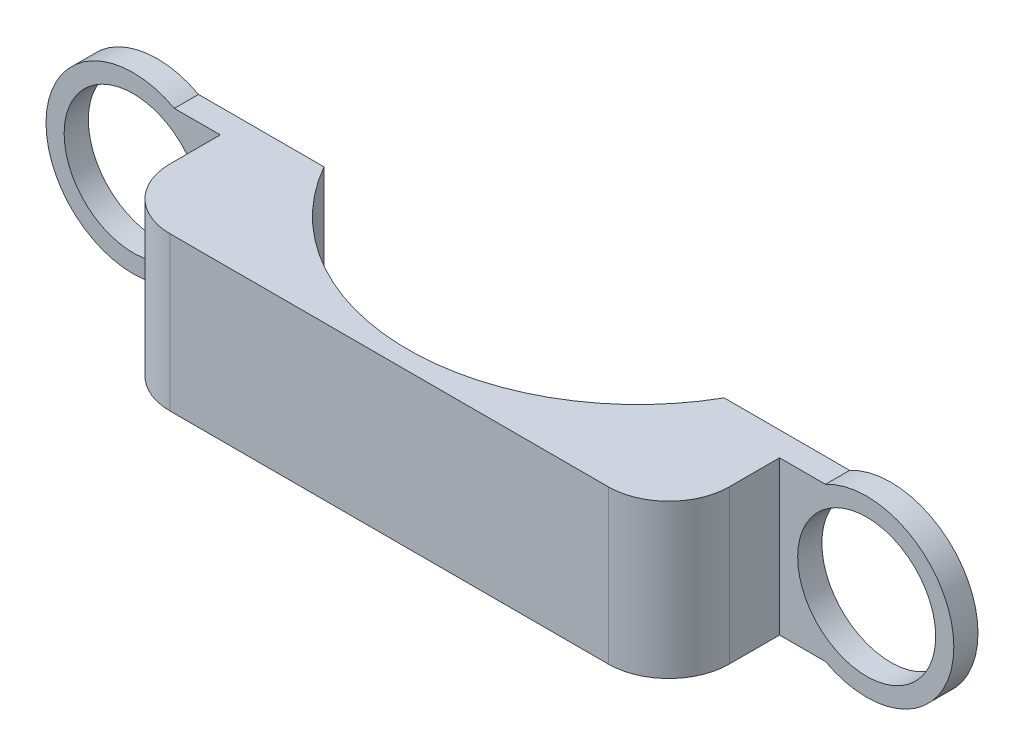
ISO-10303-21;
HEADER;
FILE_DESCRIPTION(('STEP AP214'),'2;1');
FILE_NAME('part.step','',(''),(''),'','','');
FILE_SCHEMA(('AUTOMOTIVE_DESIGN { 1 0 10303 214 1 1 1 1 }'));
ENDSEC;
DATA;
#1=APPLICATION_CONTEXT('core data for automotive mechanical design processes');
#2=APPLICATION_PROTOCOL_DEFINITION('international standard','automotive_design',2000,#1);
#3=PRODUCT_CONTEXT('',#1,'mechanical');
#4=PRODUCT('Part','Part','',(#3));
#5=PRODUCT_RELATED_PRODUCT_CATEGORY('part','',(#4));
#6=PRODUCT_DEFINITION_FORMATION('','',#4);
#7=PRODUCT_DEFINITION_CONTEXT('part definition',#1,'design');
#8=PRODUCT_DEFINITION('design','',#6,#7);
#9=PRODUCT_DEFINITION_SHAPE('','',#8);
#10=(LENGTH_UNIT() NAMED_UNIT(*) SI_UNIT(.MILLI.,.METRE.));
#11=(NAMED_UNIT(*) PLANE_ANGLE_UNIT() SI_UNIT($,.RADIAN.));
#12=(NAMED_UNIT(*) SI_UNIT($,.STERADIAN.) SOLID_ANGLE_UNIT());
#13=UNCERTAINTY_MEASURE_WITH_UNIT(LENGTH_MEASURE(1.E-05),#10,'distance_accuracy_value','');
#14=(GEOMETRIC_REPRESENTATION_CONTEXT(3) GLOBAL_UNCERTAINTY_ASSIGNED_CONTEXT((#13)) GLOBAL_UNIT_ASSIGNED_CONTEXT((#10,
#11,#12)) REPRESENTATION_CONTEXT('',''));
#15=CARTESIAN_POINT('',(0.,0.,0.));
#16=DIRECTION('',(0.,0.,1.));
#17=DIRECTION('',(1.,0.,0.));
#18=AXIS2_PLACEMENT_3D('',#15,#16,#17);
#19=CARTESIAN_POINT('',(0.,25.4,0.));
#20=DIRECTION('',(0.,1.,0.));
#21=DIRECTION('',(0.,0.,1.));
#22=AXIS2_PLACEMENT_3D('',#19,#20,#21);
#23=PLANE('',#22);
#24=CARTESIAN_POINT('',(0.,25.4,0.));
#25=DIRECTION('',(0.,-1.,0.));
#26=DIRECTION('',(0.,0.,1.));
#27=AXIS2_PLACEMENT_3D('',#24,#25,#26);
#28=CIRCLE('',#27,38.1);
#29=CARTESIAN_POINT('',(33.1004584750472,25.4,18.8671579402324));
#30=VERTEX_POINT('',#29);
#31=CARTESIAN_POINT('',(-33.1004584750472,25.4,18.8671579402324));
#32=VERTEX_POINT('',#31);
#33=EDGE_CURVE('E54',#30,#32,#28,.T.);
#34=ORIENTED_EDGE('',*,*,#33,.T.);
#35=DIRECTION('',(1.,0.,0.));
#36=VECTOR('',#35,1.);
#37=CARTESIAN_POINT('',(-46.26,25.4,18.8671579402324));
#38=LINE('',#37,#36);
#39=CARTESIAN_POINT('',(-53.8557460085432,25.4,18.8671579402324));
#40=VERTEX_POINT('',#39);
#41=EDGE_CURVE('E129',#40,#32,#38,.T.);
#42=ORIENTED_EDGE('',*,*,#41,.F.);
#43=DIRECTION('',(0.,0.,-1.));
#44=VECTOR('',#43,1.);
#45=CARTESIAN_POINT('',(-53.8557460085432,25.4,22.8671579402324));
#46=LINE('',#45,#44);
#47=CARTESIAN_POINT('',(-53.8557460085432,25.4,22.8671579402324));
#48=VERTEX_POINT('',#47);
#49=EDGE_CURVE('E277',#48,#40,#46,.T.);
#50=ORIENTED_EDGE('',*,*,#49,.F.);
#51=DIRECTION('',(1.,0.,0.));
#52=VECTOR('',#51,1.);
#53=CARTESIAN_POINT('',(-56.256783003905,25.4,22.8671579402324));
#54=LINE('',#53,#52);
#55=CARTESIAN_POINT('',(-46.26,25.4,22.8671579402324));
#56=VERTEX_POINT('',#55);
#57=EDGE_CURVE('E215',#48,#56,#54,.T.);
#58=ORIENTED_EDGE('',*,*,#57,.T.);
#59=DIRECTION('',(0.,0.,1.));
#60=VECTOR('',#59,1.);
#61=CARTESIAN_POINT('',(-46.26,25.4,22.8671579402324));
#62=LINE('',#61,#60);
#63=CARTESIAN_POINT('',(-46.26,25.4,31.1871579402324));
#64=VERTEX_POINT('',#63);
#65=EDGE_CURVE('E162',#56,#64,#62,.T.);
#66=ORIENTED_EDGE('',*,*,#65,.T.);
#67=CARTESIAN_POINT('',(-36.26,25.4,31.1871579402324));
#68=DIRECTION('',(0.,1.,0.));
#69=DIRECTION('',(0.,0.,1.));
#70=AXIS2_PLACEMENT_3D('',#67,#68,#69);
#71=CIRCLE('',#70,10.);
#72=CARTESIAN_POINT('',(-36.26,25.4,41.1871579402324));
#73=VERTEX_POINT('',#72);
#74=EDGE_CURVE('E200',#64,#73,#71,.T.);
#75=ORIENTED_EDGE('',*,*,#74,.T.);
#76=DIRECTION('',(1.,0.,0.));
#77=VECTOR('',#76,1.);
#78=CARTESIAN_POINT('',(-46.26,25.4,41.1871579402324));
#79=LINE('',#78,#77);
#80=CARTESIAN_POINT('',(36.26,25.4,41.1871579402324));
#81=VERTEX_POINT('',#80);
#82=EDGE_CURVE('E166',#73,#81,#79,.T.);
#83=ORIENTED_EDGE('',*,*,#82,.T.);
#84=CARTESIAN_POINT('',(36.26,25.4,31.1871579402324));
#85=DIRECTION('',(0.,1.,0.));
#86=DIRECTION('',(0.,0.,1.));
#87=AXIS2_PLACEMENT_3D('',#84,#85,#86);
#88=CIRCLE('',#87,10.);
#89=CARTESIAN_POINT('',(46.26,25.4,31.1871579402324));
#90=VERTEX_POINT('',#89);
#91=EDGE_CURVE('E203',#81,#90,#88,.T.);
#92=ORIENTED_EDGE('',*,*,#91,.T.);
#93=DIRECTION('',(0.,0.,-1.));
#94=VECTOR('',#93,1.);
#95=CARTESIAN_POINT('',(46.26,25.4,22.8671579402324));
#96=LINE('',#95,#94);
#97=CARTESIAN_POINT('',(46.26,25.4,22.8671579402324));
#98=VERTEX_POINT('',#97);
#99=EDGE_CURVE('E134',#90,#98,#96,.T.);
#100=ORIENTED_EDGE('',*,*,#99,.T.);
#101=DIRECTION('',(1.,0.,0.));
#102=VECTOR('',#101,1.);
#103=CARTESIAN_POINT('',(38.7002986684262,25.4,22.8671579402324));
#104=LINE('',#103,#102);
#105=CARTESIAN_POINT('',(53.8557460085432,25.4,22.8671579402324));
#106=VERTEX_POINT('',#105);
#107=EDGE_CURVE('E152',#98,#106,#104,.T.);
#108=ORIENTED_EDGE('',*,*,#107,.T.);
#109=DIRECTION('',(0.,0.,-1.));
#110=VECTOR('',#109,1.);
#111=CARTESIAN_POINT('',(53.8557460085432,25.4,22.8671579402324));
#112=LINE('',#111,#110);
#113=CARTESIAN_POINT('',(53.8557460085432,25.4,18.8671579402324));
#114=VERTEX_POINT('',#113);
#115=EDGE_CURVE('E245',#114,#106,#112,.F.);
#116=ORIENTED_EDGE('',*,*,#115,.F.);
#117=DIRECTION('',(1.,0.,0.));
#118=VECTOR('',#117,1.);
#119=CARTESIAN_POINT('',(46.26,25.4,18.8671579402324));
#120=LINE('',#119,#118);
#121=EDGE_CURVE('E131',#30,#114,#120,.T.);
#122=ORIENTED_EDGE('',*,*,#121,.F.);
#123=EDGE_LOOP('',(#34,#42,#50,#58,#66,#75,#83,#92,#100,#108,#116,#122));
#124=FACE_BOUND('',#123,.T.);
#125=ADVANCED_FACE('F39',(#124),#23,.T.);
#126=CARTESIAN_POINT('',(0.,0.,0.));
#127=DIRECTION('',(0.,1.,0.));
#128=DIRECTION('',(0.,0.,1.));
#129=AXIS2_PLACEMENT_3D('',#126,#127,#128);
#130=PLANE('',#129);
#131=DIRECTION('',(-1.,0.,0.));
#132=VECTOR('',#131,1.);
#133=CARTESIAN_POINT('',(-46.26,0.,18.8671579402324));
#134=LINE('',#133,#132);
#135=CARTESIAN_POINT('',(-33.1004584750472,0.,18.8671579402324));
#136=VERTEX_POINT('',#135);
#137=CARTESIAN_POINT('',(-53.8557460085432,0.,18.8671579402324));
#138=VERTEX_POINT('',#137);
#139=EDGE_CURVE('E144',#136,#138,#134,.T.);
#140=ORIENTED_EDGE('',*,*,#139,.F.);
#141=CARTESIAN_POINT('',(0.,0.,0.));
#142=DIRECTION('',(0.,-1.,0.));
#143=DIRECTION('',(0.,0.,1.));
#144=AXIS2_PLACEMENT_3D('',#141,#142,#143);
#145=CIRCLE('',#144,38.1);
#146=CARTESIAN_POINT('',(33.1004584750472,0.,18.8671579402324));
#147=VERTEX_POINT('',#146);
#148=EDGE_CURVE('E59',#147,#136,#145,.T.);
#149=ORIENTED_EDGE('',*,*,#148,.F.);
#150=DIRECTION('',(-1.,0.,0.));
#151=VECTOR('',#150,1.);
#152=CARTESIAN_POINT('',(46.26,0.,18.8671579402324));
#153=LINE('',#152,#151);
#154=CARTESIAN_POINT('',(53.8557460085432,0.,18.8671579402324));
#155=VERTEX_POINT('',#154);
#156=EDGE_CURVE('E149',#155,#147,#153,.T.);
#157=ORIENTED_EDGE('',*,*,#156,.F.);
#158=DIRECTION('',(0.,0.,-1.));
#159=VECTOR('',#158,1.);
#160=CARTESIAN_POINT('',(53.8557460085432,0.,22.8671579402324));
#161=LINE('',#160,#159);
#162=CARTESIAN_POINT('',(53.8557460085431,0.,22.8671579402324));
#163=VERTEX_POINT('',#162);
#164=EDGE_CURVE('E250',#155,#163,#161,.F.);
#165=ORIENTED_EDGE('',*,*,#164,.T.);
#166=DIRECTION('',(-1.,0.,0.));
#167=VECTOR('',#166,1.);
#168=CARTESIAN_POINT('',(49.3576648493526,0.,22.8671579402324));
#169=LINE('',#168,#167);
#170=CARTESIAN_POINT('',(46.26,0.,22.8671579402324));
#171=VERTEX_POINT('',#170);
#172=EDGE_CURVE('E243',#163,#171,#169,.T.);
#173=ORIENTED_EDGE('',*,*,#172,.T.);
#174=DIRECTION('',(0.,0.,-1.));
#175=VECTOR('',#174,1.);
#176=CARTESIAN_POINT('',(46.26,0.,22.8671579402324));
#177=LINE('',#176,#175);
#178=CARTESIAN_POINT('',(46.26,0.,31.1871579402324));
#179=VERTEX_POINT('',#178);
#180=EDGE_CURVE('E179',#179,#171,#177,.T.);
#181=ORIENTED_EDGE('',*,*,#180,.F.);
#182=CARTESIAN_POINT('',(36.26,0.,31.1871579402324));
#183=DIRECTION('',(0.,1.,0.));
#184=DIRECTION('',(0.,0.,1.));
#185=AXIS2_PLACEMENT_3D('',#182,#183,#184);
#186=CIRCLE('',#185,10.);
#187=CARTESIAN_POINT('',(36.26,0.,41.1871579402324));
#188=VERTEX_POINT('',#187);
#189=EDGE_CURVE('E190',#179,#188,#186,.F.);
#190=ORIENTED_EDGE('',*,*,#189,.T.);
#191=DIRECTION('',(1.,0.,0.));
#192=VECTOR('',#191,1.);
#193=CARTESIAN_POINT('',(-46.26,0.,41.1871579402324));
#194=LINE('',#193,#192);
#195=CARTESIAN_POINT('',(-36.26,0.,41.1871579402324));
#196=VERTEX_POINT('',#195);
#197=EDGE_CURVE('E175',#196,#188,#194,.T.);
#198=ORIENTED_EDGE('',*,*,#197,.F.);
#199=CARTESIAN_POINT('',(-36.26,0.,31.1871579402324));
#200=DIRECTION('',(0.,1.,0.));
#201=DIRECTION('',(0.,0.,1.));
#202=AXIS2_PLACEMENT_3D('',#199,#200,#201);
#203=CIRCLE('',#202,10.);
#204=CARTESIAN_POINT('',(-46.26,0.,31.1871579402324));
#205=VERTEX_POINT('',#204);
#206=EDGE_CURVE('E187',#196,#205,#203,.F.);
#207=ORIENTED_EDGE('',*,*,#206,.T.);
#208=DIRECTION('',(0.,0.,1.));
#209=VECTOR('',#208,1.);
#210=CARTESIAN_POINT('',(-46.26,0.,22.8671579402324));
#211=LINE('',#210,#209);
#212=CARTESIAN_POINT('',(-46.26,0.,22.8671579402324));
#213=VERTEX_POINT('',#212);
#214=EDGE_CURVE('E161',#213,#205,#211,.T.);
#215=ORIENTED_EDGE('',*,*,#214,.F.);
#216=DIRECTION('',(-1.,0.,0.));
#217=VECTOR('',#216,1.);
#218=CARTESIAN_POINT('',(-46.26,0.,22.8671579402324));
#219=LINE('',#218,#217);
#220=CARTESIAN_POINT('',(-53.8557460085432,0.,22.8671579402324));
#221=VERTEX_POINT('',#220);
#222=EDGE_CURVE('E265',#213,#221,#219,.T.);
#223=ORIENTED_EDGE('',*,*,#222,.T.);
#224=DIRECTION('',(0.,0.,-1.));
#225=VECTOR('',#224,1.);
#226=CARTESIAN_POINT('',(-53.8557460085432,0.,22.8671579402324));
#227=LINE('',#226,#225);
#228=EDGE_CURVE('E280',#221,#138,#227,.T.);
#229=ORIENTED_EDGE('',*,*,#228,.T.);
#230=EDGE_LOOP('',(#140,#149,#157,#165,#173,#181,#190,#198,#207,#215,#223,#229));
#231=FACE_BOUND('',#230,.T.);
#232=ADVANCED_FACE('F223',(#231),#130,.F.);
#233=CARTESIAN_POINT('',(0.,0.,18.8671579402324));
#234=DIRECTION('',(0.,0.,-1.));
#235=DIRECTION('',(-1.,0.,0.));
#236=AXIS2_PLACEMENT_3D('',#233,#234,#235);
#237=PLANE('',#236);
#238=CARTESIAN_POINT('',(60.675,12.7,18.8671579402324));
#239=DIRECTION('',(0.,0.,-1.));
#240=DIRECTION('',(-1.,0.,0.));
#241=AXIS2_PLACEMENT_3D('',#238,#239,#240);
#242=CIRCLE('',#241,11.415);
#243=CARTESIAN_POINT('',(49.26,12.7,18.8671579402324));
#244=VERTEX_POINT('',#243);
#245=EDGE_CURVE('E261',#244,#244,#242,.T.);
#246=ORIENTED_EDGE('',*,*,#245,.F.);
#247=EDGE_LOOP('',(#246));
#248=FACE_BOUND('',#247,.T.);
#249=ORIENTED_EDGE('',*,*,#156,.T.);
#250=DIRECTION('',(0.,-1.,0.));
#251=VECTOR('',#250,1.);
#252=CARTESIAN_POINT('',(33.1004584750472,133.16307345283,18.8671579402324));
#253=LINE('',#252,#251);
#254=EDGE_CURVE('E294',#147,#30,#253,.F.);
#255=ORIENTED_EDGE('',*,*,#254,.T.);
#256=ORIENTED_EDGE('',*,*,#121,.T.);
#257=CARTESIAN_POINT('',(60.675,12.7,18.8671579402324));
#258=DIRECTION('',(0.,0.,-1.));
#259=DIRECTION('',(-1.,0.,0.));
#260=AXIS2_PLACEMENT_3D('',#257,#258,#259);
#261=CIRCLE('',#260,14.415);
#262=EDGE_CURVE('E254',#114,#155,#261,.T.);
#263=ORIENTED_EDGE('',*,*,#262,.T.);
#264=EDGE_LOOP('',(#249,#255,#256,#263));
#265=FACE_BOUND('',#264,.T.);
#266=ADVANCED_FACE('F300',(#248,#265),#237,.T.);
#267=CARTESIAN_POINT('',(0.,0.,18.8671579402324));
#268=DIRECTION('',(0.,0.,1.));
#269=DIRECTION('',(1.,0.,0.));
#270=AXIS2_PLACEMENT_3D('',#267,#268,#269);
#271=PLANE('',#270);
#272=CARTESIAN_POINT('',(-60.675,12.7,18.8671579402324));
#273=DIRECTION('',(0.,0.,-1.));
#274=DIRECTION('',(-1.,0.,0.));
#275=AXIS2_PLACEMENT_3D('',#272,#273,#274);
#276=CIRCLE('',#275,11.415);
#277=CARTESIAN_POINT('',(-72.09,12.7,18.8671579402324));
#278=VERTEX_POINT('',#277);
#279=EDGE_CURVE('E290',#278,#278,#276,.T.);
#280=ORIENTED_EDGE('',*,*,#279,.F.);
#281=EDGE_LOOP('',(#280));
#282=FACE_BOUND('',#281,.T.);
#283=DIRECTION('',(0.,-1.,0.));
#284=VECTOR('',#283,1.);
#285=CARTESIAN_POINT('',(-33.1004584750472,133.16307345283,18.8671579402324));
#286=LINE('',#285,#284);
#287=EDGE_CURVE('E11',#136,#32,#286,.F.);
#288=ORIENTED_EDGE('',*,*,#287,.F.);
#289=ORIENTED_EDGE('',*,*,#139,.T.);
#290=CARTESIAN_POINT('',(-60.675,12.7,18.8671579402324));
#291=DIRECTION('',(0.,0.,-1.));
#292=DIRECTION('',(-1.,0.,0.));
#293=AXIS2_PLACEMENT_3D('',#290,#291,#292);
#294=CIRCLE('',#293,14.415);
#295=EDGE_CURVE('E142',#138,#40,#294,.T.);
#296=ORIENTED_EDGE('',*,*,#295,.T.);
#297=ORIENTED_EDGE('',*,*,#41,.T.);
#298=EDGE_LOOP('',(#288,#289,#296,#297));
#299=FACE_BOUND('',#298,.T.);
#300=ADVANCED_FACE('F140',(#282,#299),#271,.F.);
#301=CARTESIAN_POINT('',(46.26,25.4,22.8671579402324));
#302=DIRECTION('',(-1.,0.,0.));
#303=DIRECTION('',(0.,0.,1.));
#304=AXIS2_PLACEMENT_3D('',#301,#302,#303);
#305=PLANE('',#304);
#306=ORIENTED_EDGE('',*,*,#99,.F.);
#307=DIRECTION('',(0.,-1.,0.));
#308=VECTOR('',#307,1.);
#309=CARTESIAN_POINT('',(46.26,25.4,31.1871579402324));
#310=LINE('',#309,#308);
#311=EDGE_CURVE('E133',#90,#179,#310,.T.);
#312=ORIENTED_EDGE('',*,*,#311,.T.);
#313=ORIENTED_EDGE('',*,*,#180,.T.);
#314=DIRECTION('',(0.,-1.,0.));
#315=VECTOR('',#314,1.);
#316=CARTESIAN_POINT('',(46.26,25.4,22.8671579402324));
#317=LINE('',#316,#315);
#318=EDGE_CURVE('E145',#98,#171,#317,.T.);
#319=ORIENTED_EDGE('',*,*,#318,.F.);
#320=EDGE_LOOP('',(#306,#312,#313,#319));
#321=FACE_BOUND('',#320,.T.);
#322=ADVANCED_FACE('F232',(#321),#305,.F.);
#323=CARTESIAN_POINT('',(-46.26,25.4,22.8671579402324));
#324=DIRECTION('',(1.,0.,0.));
#325=DIRECTION('',(0.,0.,-1.));
#326=AXIS2_PLACEMENT_3D('',#323,#324,#325);
#327=PLANE('',#326);
#328=ORIENTED_EDGE('',*,*,#214,.T.);
#329=DIRECTION('',(0.,-1.,0.));
#330=VECTOR('',#329,1.);
#331=CARTESIAN_POINT('',(-46.26,25.4,31.1871579402324));
#332=LINE('',#331,#330);
#333=EDGE_CURVE('E48',#205,#64,#332,.F.);
#334=ORIENTED_EDGE('',*,*,#333,.T.);
#335=ORIENTED_EDGE('',*,*,#65,.F.);
#336=DIRECTION('',(0.,-1.,0.));
#337=VECTOR('',#336,1.);
#338=CARTESIAN_POINT('',(-46.26,25.4,22.8671579402324));
#339=LINE('',#338,#337);
#340=EDGE_CURVE('E272',#56,#213,#339,.T.);
#341=ORIENTED_EDGE('',*,*,#340,.T.);
#342=EDGE_LOOP('',(#328,#334,#335,#341));
#343=FACE_BOUND('',#342,.T.);
#344=ADVANCED_FACE('F209',(#343),#327,.F.);
#345=CARTESIAN_POINT('',(-46.26,25.4,41.1871579402324));
#346=DIRECTION('',(0.,0.,-1.));
#347=DIRECTION('',(-1.,0.,0.));
#348=AXIS2_PLACEMENT_3D('',#345,#346,#347);
#349=PLANE('',#348);
#350=ORIENTED_EDGE('',*,*,#197,.T.);
#351=DIRECTION('',(0.,-1.,0.));
#352=VECTOR('',#351,1.);
#353=CARTESIAN_POINT('',(36.26,25.4,41.1871579402324));
#354=LINE('',#353,#352);
#355=EDGE_CURVE('E197',#188,#81,#354,.F.);
#356=ORIENTED_EDGE('',*,*,#355,.T.);
#357=ORIENTED_EDGE('',*,*,#82,.F.);
#358=DIRECTION('',(0.,-1.,0.));
#359=VECTOR('',#358,1.);
#360=CARTESIAN_POINT('',(-36.26,25.4,41.1871579402324));
#361=LINE('',#360,#359);
#362=EDGE_CURVE('E193',#73,#196,#361,.T.);
#363=ORIENTED_EDGE('',*,*,#362,.T.);
#364=EDGE_LOOP('',(#350,#356,#357,#363));
#365=FACE_BOUND('',#364,.T.);
#366=ADVANCED_FACE('F220',(#365),#349,.F.);
#367=CARTESIAN_POINT('',(0.,25.4,0.));
#368=DIRECTION('',(0.,-1.,0.));
#369=DIRECTION('',(0.,0.,-1.));
#370=AXIS2_PLACEMENT_3D('',#367,#368,#369);
#371=CYLINDRICAL_SURFACE('',#370,38.1);
#372=ORIENTED_EDGE('',*,*,#148,.T.);
#373=ORIENTED_EDGE('',*,*,#287,.T.);
#374=ORIENTED_EDGE('',*,*,#33,.F.);
#375=ORIENTED_EDGE('',*,*,#254,.F.);
#376=EDGE_LOOP('',(#372,#373,#374,#375));
#377=FACE_BOUND('',#376,.T.);
#378=ADVANCED_FACE('F136',(#377),#371,.F.);
#379=CARTESIAN_POINT('',(0.,0.,22.8671579402324));
#380=DIRECTION('',(0.,0.,-1.));
#381=DIRECTION('',(-1.,0.,0.));
#382=AXIS2_PLACEMENT_3D('',#379,#380,#381);
#383=PLANE('',#382);
#384=CARTESIAN_POINT('',(60.675,12.7,22.8671579402324));
#385=DIRECTION('',(0.,0.,-1.));
#386=DIRECTION('',(-1.,0.,0.));
#387=AXIS2_PLACEMENT_3D('',#384,#385,#386);
#388=CIRCLE('',#387,14.415);
#389=EDGE_CURVE('E241',#106,#163,#388,.T.);
#390=ORIENTED_EDGE('',*,*,#389,.F.);
#391=ORIENTED_EDGE('',*,*,#107,.F.);
#392=ORIENTED_EDGE('',*,*,#318,.T.);
#393=ORIENTED_EDGE('',*,*,#172,.F.);
#394=EDGE_LOOP('',(#390,#391,#392,#393));
#395=FACE_BOUND('',#394,.T.);
#396=CARTESIAN_POINT('',(60.675,12.7,22.8671579402324));
#397=DIRECTION('',(0.,0.,-1.));
#398=DIRECTION('',(-1.,0.,0.));
#399=AXIS2_PLACEMENT_3D('',#396,#397,#398);
#400=CIRCLE('',#399,11.415);
#401=CARTESIAN_POINT('',(49.26,12.7,22.8671579402324));
#402=VERTEX_POINT('',#401);
#403=EDGE_CURVE('E258',#402,#402,#400,.T.);
#404=ORIENTED_EDGE('',*,*,#403,.T.);
#405=EDGE_LOOP('',(#404));
#406=FACE_BOUND('',#405,.T.);
#407=ADVANCED_FACE('F238',(#395,#406),#383,.F.);
#408=CARTESIAN_POINT('',(60.675,12.7,22.8671579402324));
#409=DIRECTION('',(0.,0.,-1.));
#410=DIRECTION('',(-1.,0.,0.));
#411=AXIS2_PLACEMENT_3D('',#408,#409,#410);
#412=CYLINDRICAL_SURFACE('',#411,14.415);
#413=ORIENTED_EDGE('',*,*,#262,.F.);
#414=ORIENTED_EDGE('',*,*,#115,.T.);
#415=ORIENTED_EDGE('',*,*,#389,.T.);
#416=ORIENTED_EDGE('',*,*,#164,.F.);
#417=EDGE_LOOP('',(#413,#414,#415,#416));
#418=FACE_BOUND('',#417,.T.);
#419=ADVANCED_FACE('F396',(#418),#412,.T.);
#420=CARTESIAN_POINT('',(60.675,12.7,22.8671579402324));
#421=DIRECTION('',(0.,0.,-1.));
#422=DIRECTION('',(-1.,0.,0.));
#423=AXIS2_PLACEMENT_3D('',#420,#421,#422);
#424=CYLINDRICAL_SURFACE('',#423,11.415);
#425=ORIENTED_EDGE('',*,*,#403,.F.);
#426=EDGE_LOOP('',(#425));
#427=FACE_BOUND('',#426,.T.);
#428=ORIENTED_EDGE('',*,*,#245,.T.);
#429=EDGE_LOOP('',(#428));
#430=FACE_BOUND('',#429,.T.);
#431=ADVANCED_FACE('F311',(#427,#430),#424,.F.);
#432=CARTESIAN_POINT('',(0.,0.,22.8671579402324));
#433=DIRECTION('',(0.,0.,-1.));
#434=DIRECTION('',(-1.,0.,0.));
#435=AXIS2_PLACEMENT_3D('',#432,#433,#434);
#436=PLANE('',#435);
#437=ORIENTED_EDGE('',*,*,#57,.F.);
#438=CARTESIAN_POINT('',(-60.675,12.7,22.8671579402324));
#439=DIRECTION('',(0.,0.,-1.));
#440=DIRECTION('',(-1.,0.,0.));
#441=AXIS2_PLACEMENT_3D('',#438,#439,#440);
#442=CIRCLE('',#441,14.415);
#443=EDGE_CURVE('E284',#221,#48,#442,.T.);
#444=ORIENTED_EDGE('',*,*,#443,.F.);
#445=ORIENTED_EDGE('',*,*,#222,.F.);
#446=ORIENTED_EDGE('',*,*,#340,.F.);
#447=EDGE_LOOP('',(#437,#444,#445,#446));
#448=FACE_BOUND('',#447,.T.);
#449=CARTESIAN_POINT('',(-60.675,12.7,22.8671579402324));
#450=DIRECTION('',(0.,0.,-1.));
#451=DIRECTION('',(-1.,0.,0.));
#452=AXIS2_PLACEMENT_3D('',#449,#450,#451);
#453=CIRCLE('',#452,11.415);
#454=CARTESIAN_POINT('',(-72.09,12.7,22.8671579402324));
#455=VERTEX_POINT('',#454);
#456=EDGE_CURVE('E287',#455,#455,#453,.T.);
#457=ORIENTED_EDGE('',*,*,#456,.T.);
#458=EDGE_LOOP('',(#457));
#459=FACE_BOUND('',#458,.T.);
#460=ADVANCED_FACE('F307',(#448,#459),#436,.F.);
#461=CARTESIAN_POINT('',(-60.675,12.7,22.8671579402324));
#462=DIRECTION('',(0.,0.,-1.));
#463=DIRECTION('',(-1.,0.,0.));
#464=AXIS2_PLACEMENT_3D('',#461,#462,#463);
#465=CYLINDRICAL_SURFACE('',#464,14.415);
#466=ORIENTED_EDGE('',*,*,#443,.T.);
#467=ORIENTED_EDGE('',*,*,#49,.T.);
#468=ORIENTED_EDGE('',*,*,#295,.F.);
#469=ORIENTED_EDGE('',*,*,#228,.F.);
#470=EDGE_LOOP('',(#466,#467,#468,#469));
#471=FACE_BOUND('',#470,.T.);
#472=ADVANCED_FACE('F304',(#471),#465,.T.);
#473=CARTESIAN_POINT('',(-60.675,12.7,22.8671579402324));
#474=DIRECTION('',(0.,0.,-1.));
#475=DIRECTION('',(-1.,0.,0.));
#476=AXIS2_PLACEMENT_3D('',#473,#474,#475);
#477=CYLINDRICAL_SURFACE('',#476,11.415);
#478=ORIENTED_EDGE('',*,*,#456,.F.);
#479=EDGE_LOOP('',(#478));
#480=FACE_BOUND('',#479,.T.);
#481=ORIENTED_EDGE('',*,*,#279,.T.);
#482=EDGE_LOOP('',(#481));
#483=FACE_BOUND('',#482,.T.);
#484=ADVANCED_FACE('F315',(#480,#483),#477,.F.);
#485=CARTESIAN_POINT('',(36.26,25.4,31.1871579402324));
#486=DIRECTION('',(0.,-1.,0.));
#487=DIRECTION('',(0.,0.,-1.));
#488=AXIS2_PLACEMENT_3D('',#485,#486,#487);
#489=CYLINDRICAL_SURFACE('',#488,10.);
#490=ORIENTED_EDGE('',*,*,#91,.F.);
#491=ORIENTED_EDGE('',*,*,#355,.F.);
#492=ORIENTED_EDGE('',*,*,#189,.F.);
#493=ORIENTED_EDGE('',*,*,#311,.F.);
#494=EDGE_LOOP('',(#490,#491,#492,#493));
#495=FACE_BOUND('',#494,.T.);
#496=ADVANCED_FACE('F229',(#495),#489,.T.);
#497=CARTESIAN_POINT('',(-36.26,25.4,31.1871579402324));
#498=DIRECTION('',(0.,-1.,0.));
#499=DIRECTION('',(0.,0.,-1.));
#500=AXIS2_PLACEMENT_3D('',#497,#498,#499);
#501=CYLINDRICAL_SURFACE('',#500,10.);
#502=ORIENTED_EDGE('',*,*,#74,.F.);
#503=ORIENTED_EDGE('',*,*,#333,.F.);
#504=ORIENTED_EDGE('',*,*,#206,.F.);
#505=ORIENTED_EDGE('',*,*,#362,.F.);
#506=EDGE_LOOP('',(#502,#503,#504,#505));
#507=FACE_BOUND('',#506,.T.);
#508=ADVANCED_FACE('F41',(#507),#501,.T.);
#509=CLOSED_SHELL('',(#125,#232,#266,#300,#322,#344,#366,#378,#407,#419,#431,#460,#472,#484,
#496,#508));
#510=MANIFOLD_SOLID_BREP('B2',#509);
#511=ADVANCED_BREP_SHAPE_REPRESENTATION('',(#18,#510),#14);
#512=SHAPE_DEFINITION_REPRESENTATION(#9,#511);
ENDSEC;
END-ISO-10303-21;
